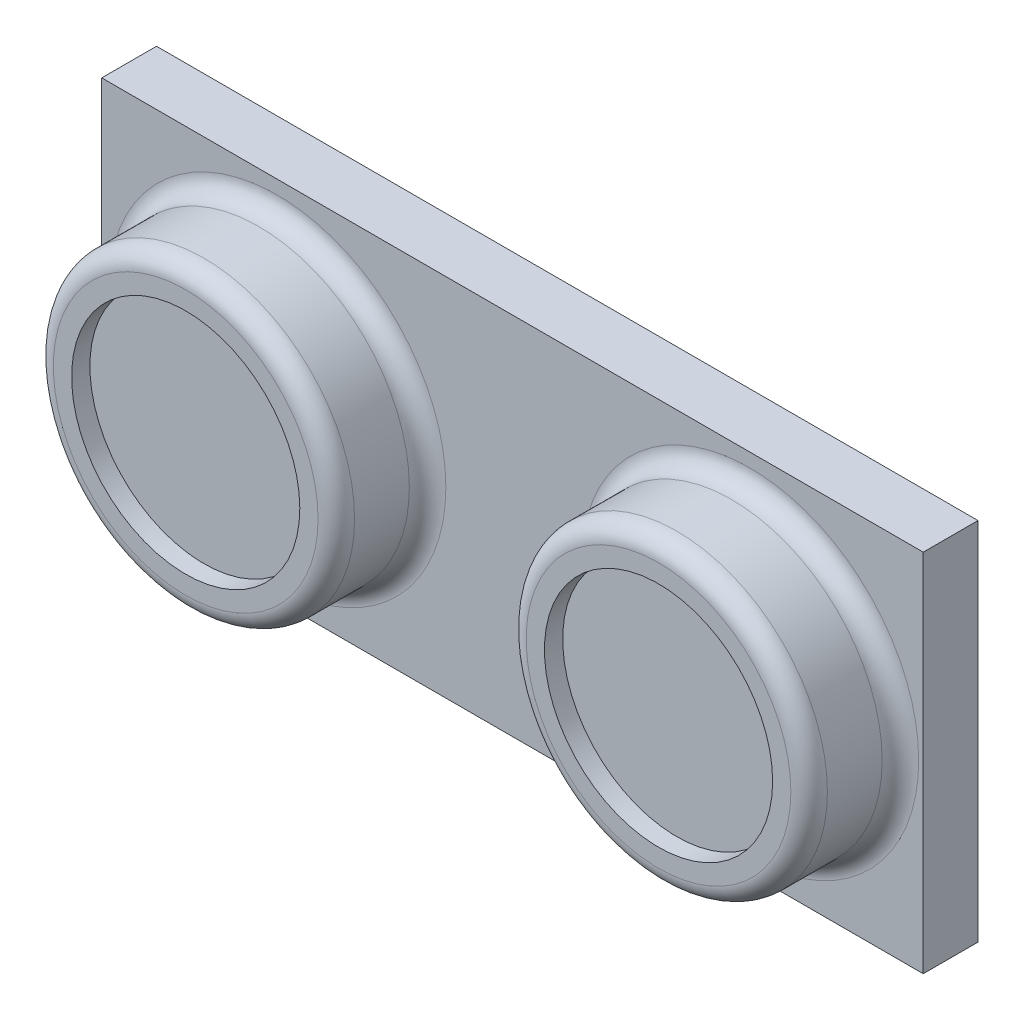
ISO-10303-21;
HEADER;
FILE_DESCRIPTION(('STEP AP214'),'2;1');
FILE_NAME('part.step','',(''),(''),'','','');
FILE_SCHEMA(('AUTOMOTIVE_DESIGN { 1 0 10303 214 1 1 1 1 }'));
ENDSEC;
DATA;
#1=APPLICATION_CONTEXT('core data for automotive mechanical design processes');
#2=APPLICATION_PROTOCOL_DEFINITION('international standard','automotive_design',2000,#1);
#3=PRODUCT_CONTEXT('',#1,'mechanical');
#4=PRODUCT('Part','Part','',(#3));
#5=PRODUCT_RELATED_PRODUCT_CATEGORY('part','',(#4));
#6=PRODUCT_DEFINITION_FORMATION('','',#4);
#7=PRODUCT_DEFINITION_CONTEXT('part definition',#1,'design');
#8=PRODUCT_DEFINITION('design','',#6,#7);
#9=PRODUCT_DEFINITION_SHAPE('','',#8);
#10=(LENGTH_UNIT() NAMED_UNIT(*) SI_UNIT(.MILLI.,.METRE.));
#11=(NAMED_UNIT(*) PLANE_ANGLE_UNIT() SI_UNIT($,.RADIAN.));
#12=(NAMED_UNIT(*) SI_UNIT($,.STERADIAN.) SOLID_ANGLE_UNIT());
#13=UNCERTAINTY_MEASURE_WITH_UNIT(LENGTH_MEASURE(1.E-05),#10,'distance_accuracy_value','');
#14=(GEOMETRIC_REPRESENTATION_CONTEXT(3) GLOBAL_UNCERTAINTY_ASSIGNED_CONTEXT((#13)) GLOBAL_UNIT_ASSIGNED_CONTEXT((#10,
#11,#12)) REPRESENTATION_CONTEXT('',''));
#15=CARTESIAN_POINT('',(0.,0.,0.));
#16=DIRECTION('',(0.,0.,1.));
#17=DIRECTION('',(1.,0.,0.));
#18=AXIS2_PLACEMENT_3D('',#15,#16,#17);
#19=CARTESIAN_POINT('',(0.,-10.,3.));
#20=DIRECTION('',(0.,1.,0.));
#21=DIRECTION('',(0.,0.,1.));
#22=AXIS2_PLACEMENT_3D('',#19,#20,#21);
#23=PLANE('',#22);
#24=DIRECTION('',(1.,0.,0.));
#25=VECTOR('',#24,1.);
#26=CARTESIAN_POINT('',(0.,-10.,0.));
#27=LINE('',#26,#25);
#28=CARTESIAN_POINT('',(-22.5,-10.,0.));
#29=VERTEX_POINT('',#28);
#30=CARTESIAN_POINT('',(22.5,-10.,0.));
#31=VERTEX_POINT('',#30);
#32=EDGE_CURVE('E105',#29,#31,#27,.T.);
#33=ORIENTED_EDGE('',*,*,#32,.T.);
#34=DIRECTION('',(0.,0.,-1.));
#35=VECTOR('',#34,1.);
#36=CARTESIAN_POINT('',(22.5,-10.,3.));
#37=LINE('',#36,#35);
#38=CARTESIAN_POINT('',(22.5,-10.,3.));
#39=VERTEX_POINT('',#38);
#40=EDGE_CURVE('E97',#39,#31,#37,.T.);
#41=ORIENTED_EDGE('',*,*,#40,.F.);
#42=DIRECTION('',(1.,0.,0.));
#43=VECTOR('',#42,1.);
#44=CARTESIAN_POINT('',(0.,-10.,3.));
#45=LINE('',#44,#43);
#46=CARTESIAN_POINT('',(-22.5,-10.,3.));
#47=VERTEX_POINT('',#46);
#48=EDGE_CURVE('E88',#47,#39,#45,.T.);
#49=ORIENTED_EDGE('',*,*,#48,.F.);
#50=DIRECTION('',(0.,0.,-1.));
#51=VECTOR('',#50,1.);
#52=CARTESIAN_POINT('',(-22.5,-10.,3.));
#53=LINE('',#52,#51);
#54=EDGE_CURVE('E54',#47,#29,#53,.T.);
#55=ORIENTED_EDGE('',*,*,#54,.T.);
#56=EDGE_LOOP('',(#33,#41,#49,#55));
#57=FACE_BOUND('',#56,.T.);
#58=ADVANCED_FACE('F37',(#57),#23,.F.);
#59=CARTESIAN_POINT('',(22.5,0.,3.));
#60=DIRECTION('',(-1.,0.,0.));
#61=DIRECTION('',(0.,0.,1.));
#62=AXIS2_PLACEMENT_3D('',#59,#60,#61);
#63=PLANE('',#62);
#64=DIRECTION('',(0.,1.,0.));
#65=VECTOR('',#64,1.);
#66=CARTESIAN_POINT('',(22.5,0.,0.));
#67=LINE('',#66,#65);
#68=CARTESIAN_POINT('',(22.5,10.,0.));
#69=VERTEX_POINT('',#68);
#70=EDGE_CURVE('E94',#31,#69,#67,.T.);
#71=ORIENTED_EDGE('',*,*,#70,.T.);
#72=DIRECTION('',(0.,0.,-1.));
#73=VECTOR('',#72,1.);
#74=CARTESIAN_POINT('',(22.5,10.,3.));
#75=LINE('',#74,#73);
#76=CARTESIAN_POINT('',(22.5,10.,3.));
#77=VERTEX_POINT('',#76);
#78=EDGE_CURVE('E92',#77,#69,#75,.T.);
#79=ORIENTED_EDGE('',*,*,#78,.F.);
#80=DIRECTION('',(0.,1.,0.));
#81=VECTOR('',#80,1.);
#82=CARTESIAN_POINT('',(22.5,0.,3.));
#83=LINE('',#82,#81);
#84=EDGE_CURVE('E80',#39,#77,#83,.T.);
#85=ORIENTED_EDGE('',*,*,#84,.F.);
#86=ORIENTED_EDGE('',*,*,#40,.T.);
#87=EDGE_LOOP('',(#71,#79,#85,#86));
#88=FACE_BOUND('',#87,.T.);
#89=ADVANCED_FACE('F93',(#88),#63,.F.);
#90=CARTESIAN_POINT('',(0.,10.,3.));
#91=DIRECTION('',(0.,1.,0.));
#92=DIRECTION('',(0.,0.,1.));
#93=AXIS2_PLACEMENT_3D('',#90,#91,#92);
#94=PLANE('',#93);
#95=DIRECTION('',(1.,0.,0.));
#96=VECTOR('',#95,1.);
#97=CARTESIAN_POINT('',(0.,10.,0.));
#98=LINE('',#97,#96);
#99=CARTESIAN_POINT('',(-22.5,10.,0.));
#100=VERTEX_POINT('',#99);
#101=EDGE_CURVE('E109',#100,#69,#98,.T.);
#102=ORIENTED_EDGE('',*,*,#101,.F.);
#103=DIRECTION('',(0.,0.,-1.));
#104=VECTOR('',#103,1.);
#105=CARTESIAN_POINT('',(-22.5,10.,3.));
#106=LINE('',#105,#104);
#107=CARTESIAN_POINT('',(-22.5,10.,3.));
#108=VERTEX_POINT('',#107);
#109=EDGE_CURVE('E68',#108,#100,#106,.T.);
#110=ORIENTED_EDGE('',*,*,#109,.F.);
#111=DIRECTION('',(1.,0.,0.));
#112=VECTOR('',#111,1.);
#113=CARTESIAN_POINT('',(0.,10.,3.));
#114=LINE('',#113,#112);
#115=EDGE_CURVE('E87',#108,#77,#114,.T.);
#116=ORIENTED_EDGE('',*,*,#115,.T.);
#117=ORIENTED_EDGE('',*,*,#78,.T.);
#118=EDGE_LOOP('',(#102,#110,#116,#117));
#119=FACE_BOUND('',#118,.T.);
#120=ADVANCED_FACE('F99',(#119),#94,.T.);
#121=CARTESIAN_POINT('',(-22.5,0.,3.));
#122=DIRECTION('',(-1.,0.,0.));
#123=DIRECTION('',(0.,0.,1.));
#124=AXIS2_PLACEMENT_3D('',#121,#122,#123);
#125=PLANE('',#124);
#126=DIRECTION('',(0.,1.,0.));
#127=VECTOR('',#126,1.);
#128=CARTESIAN_POINT('',(-22.5,0.,0.));
#129=LINE('',#128,#127);
#130=EDGE_CURVE('E111',#29,#100,#129,.T.);
#131=ORIENTED_EDGE('',*,*,#130,.F.);
#132=ORIENTED_EDGE('',*,*,#54,.F.);
#133=DIRECTION('',(0.,1.,0.));
#134=VECTOR('',#133,1.);
#135=CARTESIAN_POINT('',(-22.5,0.,3.));
#136=LINE('',#135,#134);
#137=EDGE_CURVE('E100',#47,#108,#136,.T.);
#138=ORIENTED_EDGE('',*,*,#137,.T.);
#139=ORIENTED_EDGE('',*,*,#109,.T.);
#140=EDGE_LOOP('',(#131,#132,#138,#139));
#141=FACE_BOUND('',#140,.T.);
#142=ADVANCED_FACE('F146',(#141),#125,.T.);
#143=CARTESIAN_POINT('',(0.,0.,3.));
#144=DIRECTION('',(0.,0.,1.));
#145=DIRECTION('',(1.,0.,0.));
#146=AXIS2_PLACEMENT_3D('',#143,#144,#145);
#147=PLANE('',#146);
#148=CARTESIAN_POINT('',(13.,0.,3.));
#149=DIRECTION('',(0.,0.,1.));
#150=DIRECTION('',(1.,0.,0.));
#151=AXIS2_PLACEMENT_3D('',#148,#149,#150);
#152=CIRCLE('',#151,9.25000000000001);
#153=CARTESIAN_POINT('',(22.25,0.,3.));
#154=VERTEX_POINT('',#153);
#155=EDGE_CURVE('E129',#154,#154,#152,.F.);
#156=ORIENTED_EDGE('',*,*,#155,.T.);
#157=EDGE_LOOP('',(#156));
#158=FACE_BOUND('',#157,.T.);
#159=CARTESIAN_POINT('',(-12.9,0.,3.));
#160=DIRECTION('',(0.,0.,1.));
#161=DIRECTION('',(1.,0.,0.));
#162=AXIS2_PLACEMENT_3D('',#159,#160,#161);
#163=CIRCLE('',#162,9.25);
#164=CARTESIAN_POINT('',(-3.65,0.,3.));
#165=VERTEX_POINT('',#164);
#166=EDGE_CURVE('E126',#165,#165,#163,.F.);
#167=ORIENTED_EDGE('',*,*,#166,.T.);
#168=EDGE_LOOP('',(#167));
#169=FACE_BOUND('',#168,.T.);
#170=ORIENTED_EDGE('',*,*,#48,.T.);
#171=ORIENTED_EDGE('',*,*,#84,.T.);
#172=ORIENTED_EDGE('',*,*,#115,.F.);
#173=ORIENTED_EDGE('',*,*,#137,.F.);
#174=EDGE_LOOP('',(#170,#171,#172,#173));
#175=FACE_BOUND('',#174,.T.);
#176=ADVANCED_FACE('F84',(#158,#169,#175),#147,.T.);
#177=CARTESIAN_POINT('',(0.,0.,0.));
#178=DIRECTION('',(0.,0.,1.));
#179=DIRECTION('',(1.,0.,0.));
#180=AXIS2_PLACEMENT_3D('',#177,#178,#179);
#181=PLANE('',#180);
#182=ORIENTED_EDGE('',*,*,#32,.F.);
#183=ORIENTED_EDGE('',*,*,#130,.T.);
#184=ORIENTED_EDGE('',*,*,#101,.T.);
#185=ORIENTED_EDGE('',*,*,#70,.F.);
#186=EDGE_LOOP('',(#182,#183,#184,#185));
#187=FACE_BOUND('',#186,.T.);
#188=ADVANCED_FACE('F145',(#187),#181,.F.);
#189=CARTESIAN_POINT('',(-12.9,0.,8.));
#190=DIRECTION('',(0.,0.,-1.));
#191=DIRECTION('',(-1.,0.,0.));
#192=AXIS2_PLACEMENT_3D('',#189,#190,#191);
#193=CYLINDRICAL_SURFACE('',#192,8.25);
#194=CARTESIAN_POINT('',(-12.9,0.,7.));
#195=DIRECTION('',(0.,0.,1.));
#196=DIRECTION('',(1.,0.,0.));
#197=AXIS2_PLACEMENT_3D('',#194,#195,#196);
#198=CIRCLE('',#197,8.25);
#199=CARTESIAN_POINT('',(-4.65,0.,7.));
#200=VERTEX_POINT('',#199);
#201=EDGE_CURVE('E11',#200,#200,#198,.F.);
#202=ORIENTED_EDGE('',*,*,#201,.T.);
#203=EDGE_LOOP('',(#202));
#204=FACE_BOUND('',#203,.T.);
#205=CARTESIAN_POINT('',(-12.9,0.,4.));
#206=DIRECTION('',(0.,0.,1.));
#207=DIRECTION('',(1.,0.,0.));
#208=AXIS2_PLACEMENT_3D('',#205,#206,#207);
#209=CIRCLE('',#208,8.25);
#210=CARTESIAN_POINT('',(-4.65,0.,4.));
#211=VERTEX_POINT('',#210);
#212=EDGE_CURVE('E46',#211,#211,#209,.T.);
#213=ORIENTED_EDGE('',*,*,#212,.T.);
#214=EDGE_LOOP('',(#213));
#215=FACE_BOUND('',#214,.T.);
#216=ADVANCED_FACE('F137',(#204,#215),#193,.T.);
#217=CARTESIAN_POINT('',(0.,0.,8.));
#218=DIRECTION('',(0.,0.,1.));
#219=DIRECTION('',(1.,0.,0.));
#220=AXIS2_PLACEMENT_3D('',#217,#218,#219);
#221=PLANE('',#220);
#222=CARTESIAN_POINT('',(-12.9,0.,8.));
#223=DIRECTION('',(0.,0.,1.));
#224=DIRECTION('',(1.,0.,0.));
#225=AXIS2_PLACEMENT_3D('',#222,#223,#224);
#226=CIRCLE('',#225,7.25);
#227=CARTESIAN_POINT('',(-5.65,0.,8.));
#228=VERTEX_POINT('',#227);
#229=EDGE_CURVE('E132',#228,#228,#226,.T.);
#230=ORIENTED_EDGE('',*,*,#229,.T.);
#231=EDGE_LOOP('',(#230));
#232=FACE_BOUND('',#231,.T.);
#233=CARTESIAN_POINT('',(-12.9,0.,8.));
#234=DIRECTION('',(0.,0.,1.));
#235=DIRECTION('',(1.,0.,0.));
#236=AXIS2_PLACEMENT_3D('',#233,#234,#235);
#237=CIRCLE('',#236,6.25);
#238=CARTESIAN_POINT('',(-6.65,0.,8.));
#239=VERTEX_POINT('',#238);
#240=EDGE_CURVE('E188',#239,#239,#237,.T.);
#241=ORIENTED_EDGE('',*,*,#240,.F.);
#242=EDGE_LOOP('',(#241));
#243=FACE_BOUND('',#242,.T.);
#244=ADVANCED_FACE('F181',(#232,#243),#221,.T.);
#245=CARTESIAN_POINT('',(13.,0.,8.));
#246=DIRECTION('',(0.,0.,-1.));
#247=DIRECTION('',(-1.,0.,0.));
#248=AXIS2_PLACEMENT_3D('',#245,#246,#247);
#249=CYLINDRICAL_SURFACE('',#248,8.25000000000001);
#250=CARTESIAN_POINT('',(13.,0.,7.));
#251=DIRECTION('',(0.,0.,1.));
#252=DIRECTION('',(1.,0.,0.));
#253=AXIS2_PLACEMENT_3D('',#250,#251,#252);
#254=CIRCLE('',#253,8.25000000000001);
#255=CARTESIAN_POINT('',(21.25,0.,7.));
#256=VERTEX_POINT('',#255);
#257=EDGE_CURVE('E123',#256,#256,#254,.F.);
#258=ORIENTED_EDGE('',*,*,#257,.T.);
#259=EDGE_LOOP('',(#258));
#260=FACE_BOUND('',#259,.T.);
#261=CARTESIAN_POINT('',(13.,0.,4.));
#262=DIRECTION('',(0.,0.,1.));
#263=DIRECTION('',(1.,0.,0.));
#264=AXIS2_PLACEMENT_3D('',#261,#262,#263);
#265=CIRCLE('',#264,8.25000000000001);
#266=CARTESIAN_POINT('',(21.25,0.,4.));
#267=VERTEX_POINT('',#266);
#268=EDGE_CURVE('E120',#267,#267,#265,.T.);
#269=ORIENTED_EDGE('',*,*,#268,.T.);
#270=EDGE_LOOP('',(#269));
#271=FACE_BOUND('',#270,.T.);
#272=ADVANCED_FACE('F184',(#260,#271),#249,.T.);
#273=CARTESIAN_POINT('',(0.,0.,8.));
#274=DIRECTION('',(0.,0.,1.));
#275=DIRECTION('',(1.,0.,0.));
#276=AXIS2_PLACEMENT_3D('',#273,#274,#275);
#277=PLANE('',#276);
#278=CARTESIAN_POINT('',(13.,0.,8.));
#279=DIRECTION('',(0.,0.,1.));
#280=DIRECTION('',(1.,0.,0.));
#281=AXIS2_PLACEMENT_3D('',#278,#279,#280);
#282=CIRCLE('',#281,7.25000000000001);
#283=CARTESIAN_POINT('',(20.25,0.,8.));
#284=VERTEX_POINT('',#283);
#285=EDGE_CURVE('E117',#284,#284,#282,.T.);
#286=ORIENTED_EDGE('',*,*,#285,.T.);
#287=EDGE_LOOP('',(#286));
#288=FACE_BOUND('',#287,.T.);
#289=CARTESIAN_POINT('',(13.,0.,8.));
#290=DIRECTION('',(0.,0.,1.));
#291=DIRECTION('',(1.,0.,0.));
#292=AXIS2_PLACEMENT_3D('',#289,#290,#291);
#293=CIRCLE('',#292,6.25000000000001);
#294=CARTESIAN_POINT('',(19.25,0.,8.));
#295=VERTEX_POINT('',#294);
#296=EDGE_CURVE('E193',#295,#295,#293,.T.);
#297=ORIENTED_EDGE('',*,*,#296,.F.);
#298=EDGE_LOOP('',(#297));
#299=FACE_BOUND('',#298,.T.);
#300=ADVANCED_FACE('F206',(#288,#299),#277,.T.);
#301=CARTESIAN_POINT('',(13.,0.,7.));
#302=DIRECTION('',(0.,0.,1.));
#303=DIRECTION('',(1.,0.,0.));
#304=AXIS2_PLACEMENT_3D('',#301,#302,#303);
#305=CYLINDRICAL_SURFACE('',#304,6.25000000000001);
#306=CARTESIAN_POINT('',(13.,0.,7.));
#307=DIRECTION('',(0.,0.,1.));
#308=DIRECTION('',(1.,0.,0.));
#309=AXIS2_PLACEMENT_3D('',#306,#307,#308);
#310=CIRCLE('',#309,6.25000000000001);
#311=CARTESIAN_POINT('',(19.25,0.,7.));
#312=VERTEX_POINT('',#311);
#313=EDGE_CURVE('E107',#312,#312,#310,.T.);
#314=ORIENTED_EDGE('',*,*,#313,.F.);
#315=EDGE_LOOP('',(#314));
#316=FACE_BOUND('',#315,.T.);
#317=ORIENTED_EDGE('',*,*,#296,.T.);
#318=EDGE_LOOP('',(#317));
#319=FACE_BOUND('',#318,.T.);
#320=ADVANCED_FACE('F203',(#316,#319),#305,.F.);
#321=CARTESIAN_POINT('',(13.,0.,7.));
#322=DIRECTION('',(0.,0.,1.));
#323=DIRECTION('',(1.,0.,0.));
#324=AXIS2_PLACEMENT_3D('',#321,#322,#323);
#325=PLANE('',#324);
#326=ORIENTED_EDGE('',*,*,#313,.T.);
#327=EDGE_LOOP('',(#326));
#328=FACE_BOUND('',#327,.T.);
#329=ADVANCED_FACE('F201',(#328),#325,.T.);
#330=CARTESIAN_POINT('',(-12.9,0.,7.));
#331=DIRECTION('',(0.,0.,1.));
#332=DIRECTION('',(1.,0.,0.));
#333=AXIS2_PLACEMENT_3D('',#330,#331,#332);
#334=CYLINDRICAL_SURFACE('',#333,6.25);
#335=CARTESIAN_POINT('',(-12.9,0.,7.));
#336=DIRECTION('',(0.,0.,1.));
#337=DIRECTION('',(1.,0.,0.));
#338=AXIS2_PLACEMENT_3D('',#335,#336,#337);
#339=CIRCLE('',#338,6.25);
#340=CARTESIAN_POINT('',(-6.65,0.,7.));
#341=VERTEX_POINT('',#340);
#342=EDGE_CURVE('E190',#341,#341,#339,.T.);
#343=ORIENTED_EDGE('',*,*,#342,.F.);
#344=EDGE_LOOP('',(#343));
#345=FACE_BOUND('',#344,.T.);
#346=ORIENTED_EDGE('',*,*,#240,.T.);
#347=EDGE_LOOP('',(#346));
#348=FACE_BOUND('',#347,.T.);
#349=ADVANCED_FACE('F219',(#345,#348),#334,.F.);
#350=CARTESIAN_POINT('',(-12.9,0.,7.));
#351=DIRECTION('',(0.,0.,1.));
#352=DIRECTION('',(1.,0.,0.));
#353=AXIS2_PLACEMENT_3D('',#350,#351,#352);
#354=PLANE('',#353);
#355=ORIENTED_EDGE('',*,*,#342,.T.);
#356=EDGE_LOOP('',(#355));
#357=FACE_BOUND('',#356,.T.);
#358=ADVANCED_FACE('F169',(#357),#354,.T.);
#359=CARTESIAN_POINT('',(13.,0.,7.));
#360=DIRECTION('',(0.,0.,1.));
#361=DIRECTION('',(1.,0.,0.));
#362=AXIS2_PLACEMENT_3D('',#359,#360,#361);
#363=TOROIDAL_SURFACE('',#362,7.25000000000001,1.);
#364=ORIENTED_EDGE('',*,*,#257,.F.);
#365=EDGE_LOOP('',(#364));
#366=FACE_BOUND('',#365,.T.);
#367=ORIENTED_EDGE('',*,*,#285,.F.);
#368=EDGE_LOOP('',(#367));
#369=FACE_BOUND('',#368,.T.);
#370=ADVANCED_FACE('F165',(#366,#369),#363,.T.);
#371=CARTESIAN_POINT('',(13.,0.,4.));
#372=DIRECTION('',(0.,0.,1.));
#373=DIRECTION('',(1.,0.,0.));
#374=AXIS2_PLACEMENT_3D('',#371,#372,#373);
#375=TOROIDAL_SURFACE('',#374,9.25000000000001,1.);
#376=ORIENTED_EDGE('',*,*,#268,.F.);
#377=EDGE_LOOP('',(#376));
#378=FACE_BOUND('',#377,.T.);
#379=ORIENTED_EDGE('',*,*,#155,.F.);
#380=EDGE_LOOP('',(#379));
#381=FACE_BOUND('',#380,.T.);
#382=ADVANCED_FACE('F168',(#378,#381),#375,.F.);
#383=CARTESIAN_POINT('',(-12.9,0.,7.));
#384=DIRECTION('',(0.,0.,1.));
#385=DIRECTION('',(1.,0.,0.));
#386=AXIS2_PLACEMENT_3D('',#383,#384,#385);
#387=TOROIDAL_SURFACE('',#386,7.25,1.);
#388=ORIENTED_EDGE('',*,*,#201,.F.);
#389=EDGE_LOOP('',(#388));
#390=FACE_BOUND('',#389,.T.);
#391=ORIENTED_EDGE('',*,*,#229,.F.);
#392=EDGE_LOOP('',(#391));
#393=FACE_BOUND('',#392,.T.);
#394=ADVANCED_FACE('F141',(#390,#393),#387,.T.);
#395=CARTESIAN_POINT('',(-12.9,0.,4.));
#396=DIRECTION('',(0.,0.,1.));
#397=DIRECTION('',(1.,0.,0.));
#398=AXIS2_PLACEMENT_3D('',#395,#396,#397);
#399=TOROIDAL_SURFACE('',#398,9.25,1.);
#400=ORIENTED_EDGE('',*,*,#212,.F.);
#401=EDGE_LOOP('',(#400));
#402=FACE_BOUND('',#401,.T.);
#403=ORIENTED_EDGE('',*,*,#166,.F.);
#404=EDGE_LOOP('',(#403));
#405=FACE_BOUND('',#404,.T.);
#406=ADVANCED_FACE('F39',(#402,#405),#399,.F.);
#407=CLOSED_SHELL('',(#58,#89,#120,#142,#176,#188,#216,#244,#272,#300,#320,#329,#349,#358,#370,
#382,#394,#406));
#408=MANIFOLD_SOLID_BREP('B2',#407);
#409=ADVANCED_BREP_SHAPE_REPRESENTATION('',(#18,#408),#14);
#410=SHAPE_DEFINITION_REPRESENTATION(#9,#409);
ENDSEC;
END-ISO-10303-21;
